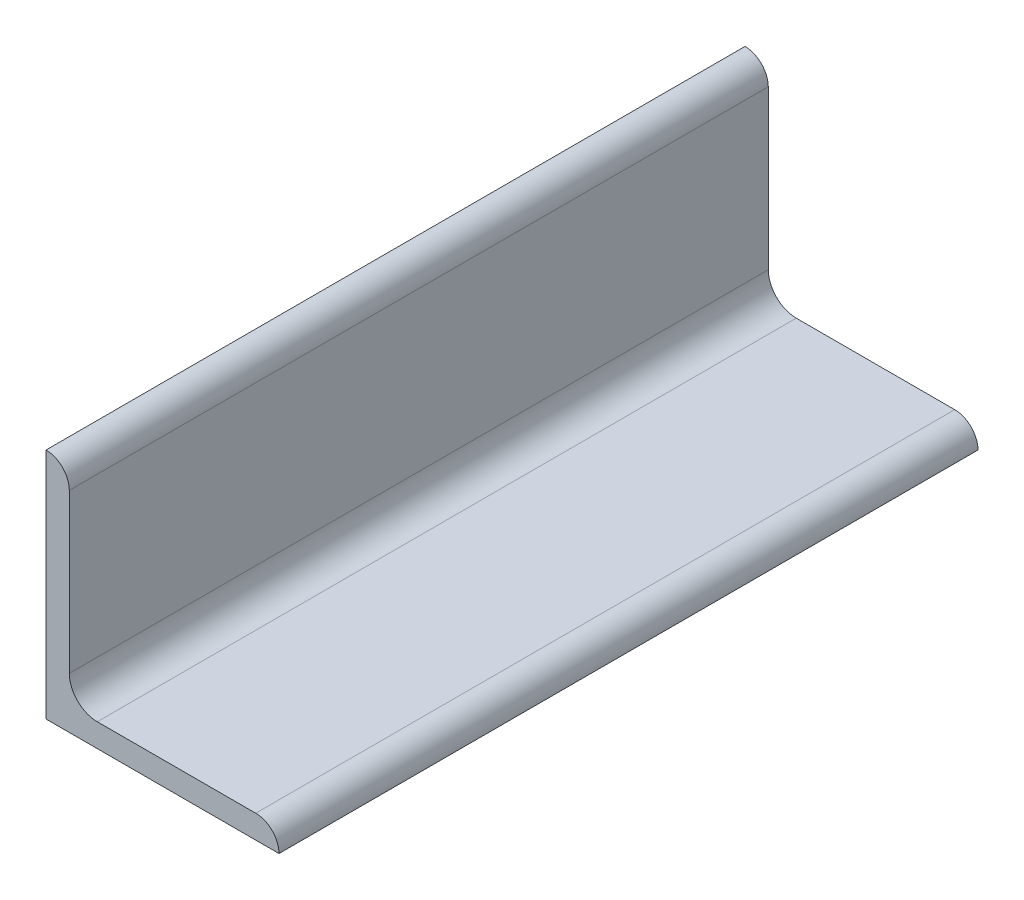
ISO-10303-21;
HEADER;
FILE_DESCRIPTION(('STEP AP214'),'2;1');
FILE_NAME('part.step','',(''),(''),'','','');
FILE_SCHEMA(('AUTOMOTIVE_DESIGN { 1 0 10303 214 1 1 1 1 }'));
ENDSEC;
DATA;
#1=APPLICATION_CONTEXT('core data for automotive mechanical design processes');
#2=APPLICATION_PROTOCOL_DEFINITION('international standard','automotive_design',2000,#1);
#3=PRODUCT_CONTEXT('',#1,'mechanical');
#4=PRODUCT('Part','Part','',(#3));
#5=PRODUCT_RELATED_PRODUCT_CATEGORY('part','',(#4));
#6=PRODUCT_DEFINITION_FORMATION('','',#4);
#7=PRODUCT_DEFINITION_CONTEXT('part definition',#1,'design');
#8=PRODUCT_DEFINITION('design','',#6,#7);
#9=PRODUCT_DEFINITION_SHAPE('','',#8);
#10=(LENGTH_UNIT() NAMED_UNIT(*) SI_UNIT(.MILLI.,.METRE.));
#11=(NAMED_UNIT(*) PLANE_ANGLE_UNIT() SI_UNIT($,.RADIAN.));
#12=(NAMED_UNIT(*) SI_UNIT($,.STERADIAN.) SOLID_ANGLE_UNIT());
#13=UNCERTAINTY_MEASURE_WITH_UNIT(LENGTH_MEASURE(1.E-05),#10,'distance_accuracy_value','');
#14=(GEOMETRIC_REPRESENTATION_CONTEXT(3) GLOBAL_UNCERTAINTY_ASSIGNED_CONTEXT((#13)) GLOBAL_UNIT_ASSIGNED_CONTEXT((#10,
#11,#12)) REPRESENTATION_CONTEXT('',''));
#15=CARTESIAN_POINT('',(0.,0.,0.));
#16=DIRECTION('',(0.,0.,1.));
#17=DIRECTION('',(1.,0.,0.));
#18=AXIS2_PLACEMENT_3D('',#15,#16,#17);
#19=CARTESIAN_POINT('',(100.,0.,150.));
#20=DIRECTION('',(0.,1.,0.));
#21=DIRECTION('',(-1.,0.,0.));
#22=AXIS2_PLACEMENT_3D('',#19,#20,#21);
#23=PLANE('',#22);
#24=DIRECTION('',(1.,0.,0.));
#25=VECTOR('',#24,1.);
#26=CARTESIAN_POINT('',(100.,0.,-150.));
#27=LINE('',#26,#25);
#28=CARTESIAN_POINT('',(0.,0.,-150.));
#29=VERTEX_POINT('',#28);
#30=CARTESIAN_POINT('',(100.,0.,-150.));
#31=VERTEX_POINT('',#30);
#32=EDGE_CURVE('E106',#29,#31,#27,.T.);
#33=ORIENTED_EDGE('',*,*,#32,.T.);
#34=DIRECTION('',(0.,0.,-1.));
#35=VECTOR('',#34,1.);
#36=CARTESIAN_POINT('',(100.,0.,150.));
#37=LINE('',#36,#35);
#38=CARTESIAN_POINT('',(100.,0.,150.));
#39=VERTEX_POINT('',#38);
#40=EDGE_CURVE('E104',#39,#31,#37,.T.);
#41=ORIENTED_EDGE('',*,*,#40,.F.);
#42=DIRECTION('',(1.,0.,0.));
#43=VECTOR('',#42,1.);
#44=CARTESIAN_POINT('',(100.,0.,150.));
#45=LINE('',#44,#43);
#46=CARTESIAN_POINT('',(0.,0.,150.));
#47=VERTEX_POINT('',#46);
#48=EDGE_CURVE('E91',#47,#39,#45,.T.);
#49=ORIENTED_EDGE('',*,*,#48,.F.);
#50=DIRECTION('',(0.,0.,-1.));
#51=VECTOR('',#50,1.);
#52=CARTESIAN_POINT('',(0.,0.,150.));
#53=LINE('',#52,#51);
#54=EDGE_CURVE('E126',#47,#29,#53,.T.);
#55=ORIENTED_EDGE('',*,*,#54,.T.);
#56=EDGE_LOOP('',(#33,#41,#49,#55));
#57=FACE_BOUND('',#56,.T.);
#58=ADVANCED_FACE('F32',(#57),#23,.F.);
#59=CARTESIAN_POINT('',(22.,9.99999999999999,150.));
#60=DIRECTION('',(0.,-1.,0.));
#61=DIRECTION('',(0.,0.,-1.));
#62=AXIS2_PLACEMENT_3D('',#59,#60,#61);
#63=PLANE('',#62);
#64=DIRECTION('',(-1.,0.,0.));
#65=VECTOR('',#64,1.);
#66=CARTESIAN_POINT('',(22.,9.99999999999999,150.));
#67=LINE('',#66,#65);
#68=CARTESIAN_POINT('',(90.,9.99999999999999,150.));
#69=VERTEX_POINT('',#68);
#70=CARTESIAN_POINT('',(22.,9.99999999999999,150.));
#71=VERTEX_POINT('',#70);
#72=EDGE_CURVE('E99',#69,#71,#67,.T.);
#73=ORIENTED_EDGE('',*,*,#72,.F.);
#74=DIRECTION('',(0.,0.,-1.));
#75=VECTOR('',#74,1.);
#76=CARTESIAN_POINT('',(90.,9.99999999999999,150.));
#77=LINE('',#76,#75);
#78=CARTESIAN_POINT('',(90.,9.99999999999999,-150.));
#79=VERTEX_POINT('',#78);
#80=EDGE_CURVE('E11',#69,#79,#77,.T.);
#81=ORIENTED_EDGE('',*,*,#80,.T.);
#82=DIRECTION('',(-1.,0.,0.));
#83=VECTOR('',#82,1.);
#84=CARTESIAN_POINT('',(22.,9.99999999999999,-150.));
#85=LINE('',#84,#83);
#86=CARTESIAN_POINT('',(22.,9.99999999999999,-150.));
#87=VERTEX_POINT('',#86);
#88=EDGE_CURVE('E133',#79,#87,#85,.T.);
#89=ORIENTED_EDGE('',*,*,#88,.T.);
#90=DIRECTION('',(0.,0.,-1.));
#91=VECTOR('',#90,1.);
#92=CARTESIAN_POINT('',(22.,9.99999999999999,150.));
#93=LINE('',#92,#91);
#94=EDGE_CURVE('E109',#71,#87,#93,.T.);
#95=ORIENTED_EDGE('',*,*,#94,.F.);
#96=EDGE_LOOP('',(#73,#81,#89,#95));
#97=FACE_BOUND('',#96,.T.);
#98=ADVANCED_FACE('F145',(#97),#63,.F.);
#99=CARTESIAN_POINT('',(22.,22.,150.));
#100=DIRECTION('',(0.,0.,-1.));
#101=DIRECTION('',(-1.,0.,0.));
#102=AXIS2_PLACEMENT_3D('',#99,#100,#101);
#103=CYLINDRICAL_SURFACE('',#102,12.);
#104=CARTESIAN_POINT('',(22.,22.,-150.));
#105=DIRECTION('',(0.,0.,-1.));
#106=DIRECTION('',(-1.,0.,0.));
#107=AXIS2_PLACEMENT_3D('',#104,#105,#106);
#108=CIRCLE('',#107,12.);
#109=CARTESIAN_POINT('',(10.,22.,-150.));
#110=VERTEX_POINT('',#109);
#111=EDGE_CURVE('E131',#87,#110,#108,.T.);
#112=ORIENTED_EDGE('',*,*,#111,.T.);
#113=DIRECTION('',(0.,0.,-1.));
#114=VECTOR('',#113,1.);
#115=CARTESIAN_POINT('',(10.,22.,150.));
#116=LINE('',#115,#114);
#117=CARTESIAN_POINT('',(10.,22.,150.));
#118=VERTEX_POINT('',#117);
#119=EDGE_CURVE('E120',#118,#110,#116,.T.);
#120=ORIENTED_EDGE('',*,*,#119,.F.);
#121=CARTESIAN_POINT('',(22.,22.,150.));
#122=DIRECTION('',(0.,0.,-1.));
#123=DIRECTION('',(-1.,0.,0.));
#124=AXIS2_PLACEMENT_3D('',#121,#122,#123);
#125=CIRCLE('',#124,12.);
#126=EDGE_CURVE('E139',#71,#118,#125,.T.);
#127=ORIENTED_EDGE('',*,*,#126,.F.);
#128=ORIENTED_EDGE('',*,*,#94,.T.);
#129=EDGE_LOOP('',(#112,#120,#127,#128));
#130=FACE_BOUND('',#129,.T.);
#131=ADVANCED_FACE('F149',(#130),#103,.F.);
#132=CARTESIAN_POINT('',(9.99999999999999,100.,150.));
#133=DIRECTION('',(-1.,0.,0.));
#134=DIRECTION('',(0.,-1.,0.));
#135=AXIS2_PLACEMENT_3D('',#132,#133,#134);
#136=PLANE('',#135);
#137=DIRECTION('',(0.,1.,0.));
#138=VECTOR('',#137,1.);
#139=CARTESIAN_POINT('',(9.99999999999999,100.,-150.));
#140=LINE('',#139,#138);
#141=CARTESIAN_POINT('',(10.,90.,-150.));
#142=VERTEX_POINT('',#141);
#143=EDGE_CURVE('E129',#110,#142,#140,.T.);
#144=ORIENTED_EDGE('',*,*,#143,.T.);
#145=DIRECTION('',(0.,0.,-1.));
#146=VECTOR('',#145,1.);
#147=CARTESIAN_POINT('',(10.,90.,150.));
#148=LINE('',#147,#146);
#149=CARTESIAN_POINT('',(10.,90.,150.));
#150=VERTEX_POINT('',#149);
#151=EDGE_CURVE('E55',#142,#150,#148,.F.);
#152=ORIENTED_EDGE('',*,*,#151,.T.);
#153=DIRECTION('',(0.,1.,0.));
#154=VECTOR('',#153,1.);
#155=CARTESIAN_POINT('',(9.99999999999999,100.,150.));
#156=LINE('',#155,#154);
#157=EDGE_CURVE('E137',#118,#150,#156,.T.);
#158=ORIENTED_EDGE('',*,*,#157,.F.);
#159=ORIENTED_EDGE('',*,*,#119,.T.);
#160=EDGE_LOOP('',(#144,#152,#158,#159));
#161=FACE_BOUND('',#160,.T.);
#162=ADVANCED_FACE('F151',(#161),#136,.F.);
#163=CARTESIAN_POINT('',(0.,100.,150.));
#164=DIRECTION('',(1.,0.,0.));
#165=DIRECTION('',(0.,1.,0.));
#166=AXIS2_PLACEMENT_3D('',#163,#164,#165);
#167=PLANE('',#166);
#168=DIRECTION('',(0.,-1.,0.));
#169=VECTOR('',#168,1.);
#170=CARTESIAN_POINT('',(0.,100.,-150.));
#171=LINE('',#170,#169);
#172=CARTESIAN_POINT('',(0.,100.,-150.));
#173=VERTEX_POINT('',#172);
#174=EDGE_CURVE('E100',#173,#29,#171,.T.);
#175=ORIENTED_EDGE('',*,*,#174,.T.);
#176=ORIENTED_EDGE('',*,*,#54,.F.);
#177=DIRECTION('',(0.,-1.,0.));
#178=VECTOR('',#177,1.);
#179=CARTESIAN_POINT('',(0.,100.,150.));
#180=LINE('',#179,#178);
#181=CARTESIAN_POINT('',(0.,100.,150.));
#182=VERTEX_POINT('',#181);
#183=EDGE_CURVE('E95',#182,#47,#180,.T.);
#184=ORIENTED_EDGE('',*,*,#183,.F.);
#185=DIRECTION('',(0.,0.,-1.));
#186=VECTOR('',#185,1.);
#187=CARTESIAN_POINT('',(0.,100.,150.));
#188=LINE('',#187,#186);
#189=EDGE_CURVE('E123',#182,#173,#188,.T.);
#190=ORIENTED_EDGE('',*,*,#189,.T.);
#191=EDGE_LOOP('',(#175,#176,#184,#190));
#192=FACE_BOUND('',#191,.T.);
#193=ADVANCED_FACE('F158',(#192),#167,.F.);
#194=CARTESIAN_POINT('',(22.,22.,150.));
#195=DIRECTION('',(0.,0.,-1.));
#196=DIRECTION('',(-1.,0.,0.));
#197=AXIS2_PLACEMENT_3D('',#194,#195,#196);
#198=PLANE('',#197);
#199=ORIENTED_EDGE('',*,*,#157,.T.);
#200=CARTESIAN_POINT('',(0.,90.,150.));
#201=DIRECTION('',(0.,0.,-1.));
#202=DIRECTION('',(-1.,0.,0.));
#203=AXIS2_PLACEMENT_3D('',#200,#201,#202);
#204=CIRCLE('',#203,10.);
#205=EDGE_CURVE('E40',#150,#182,#204,.F.);
#206=ORIENTED_EDGE('',*,*,#205,.T.);
#207=ORIENTED_EDGE('',*,*,#183,.T.);
#208=ORIENTED_EDGE('',*,*,#48,.T.);
#209=CARTESIAN_POINT('',(90.,0.,150.));
#210=DIRECTION('',(0.,0.,-1.));
#211=DIRECTION('',(-1.,0.,0.));
#212=AXIS2_PLACEMENT_3D('',#209,#210,#211);
#213=CIRCLE('',#212,10.);
#214=EDGE_CURVE('E47',#39,#69,#213,.F.);
#215=ORIENTED_EDGE('',*,*,#214,.T.);
#216=ORIENTED_EDGE('',*,*,#72,.T.);
#217=ORIENTED_EDGE('',*,*,#126,.T.);
#218=EDGE_LOOP('',(#199,#206,#207,#208,#215,#216,#217));
#219=FACE_BOUND('',#218,.T.);
#220=ADVANCED_FACE('F93',(#219),#198,.F.);
#221=CARTESIAN_POINT('',(22.,22.,-150.));
#222=DIRECTION('',(0.,0.,-1.));
#223=DIRECTION('',(-1.,0.,0.));
#224=AXIS2_PLACEMENT_3D('',#221,#222,#223);
#225=PLANE('',#224);
#226=ORIENTED_EDGE('',*,*,#174,.F.);
#227=CARTESIAN_POINT('',(0.,90.,-150.));
#228=DIRECTION('',(0.,0.,-1.));
#229=DIRECTION('',(-1.,0.,0.));
#230=AXIS2_PLACEMENT_3D('',#227,#228,#229);
#231=CIRCLE('',#230,10.);
#232=EDGE_CURVE('E113',#173,#142,#231,.T.);
#233=ORIENTED_EDGE('',*,*,#232,.T.);
#234=ORIENTED_EDGE('',*,*,#143,.F.);
#235=ORIENTED_EDGE('',*,*,#111,.F.);
#236=ORIENTED_EDGE('',*,*,#88,.F.);
#237=CARTESIAN_POINT('',(90.,0.,-150.));
#238=DIRECTION('',(0.,0.,-1.));
#239=DIRECTION('',(-1.,0.,0.));
#240=AXIS2_PLACEMENT_3D('',#237,#238,#239);
#241=CIRCLE('',#240,10.);
#242=EDGE_CURVE('E108',#79,#31,#241,.T.);
#243=ORIENTED_EDGE('',*,*,#242,.T.);
#244=ORIENTED_EDGE('',*,*,#32,.F.);
#245=EDGE_LOOP('',(#226,#233,#234,#235,#236,#243,#244));
#246=FACE_BOUND('',#245,.T.);
#247=ADVANCED_FACE('F160',(#246),#225,.T.);
#248=CARTESIAN_POINT('',(0.,90.,150.));
#249=DIRECTION('',(0.,0.,-1.));
#250=DIRECTION('',(-1.,0.,0.));
#251=AXIS2_PLACEMENT_3D('',#248,#249,#250);
#252=CYLINDRICAL_SURFACE('',#251,10.);
#253=ORIENTED_EDGE('',*,*,#205,.F.);
#254=ORIENTED_EDGE('',*,*,#151,.F.);
#255=ORIENTED_EDGE('',*,*,#232,.F.);
#256=ORIENTED_EDGE('',*,*,#189,.F.);
#257=EDGE_LOOP('',(#253,#254,#255,#256));
#258=FACE_BOUND('',#257,.T.);
#259=ADVANCED_FACE('F155',(#258),#252,.T.);
#260=CARTESIAN_POINT('',(90.,0.,150.));
#261=DIRECTION('',(0.,0.,-1.));
#262=DIRECTION('',(-1.,0.,0.));
#263=AXIS2_PLACEMENT_3D('',#260,#261,#262);
#264=CYLINDRICAL_SURFACE('',#263,10.);
#265=ORIENTED_EDGE('',*,*,#214,.F.);
#266=ORIENTED_EDGE('',*,*,#40,.T.);
#267=ORIENTED_EDGE('',*,*,#242,.F.);
#268=ORIENTED_EDGE('',*,*,#80,.F.);
#269=EDGE_LOOP('',(#265,#266,#267,#268));
#270=FACE_BOUND('',#269,.T.);
#271=ADVANCED_FACE('F34',(#270),#264,.T.);
#272=CLOSED_SHELL('',(#58,#98,#131,#162,#193,#220,#247,#259,#271));
#273=MANIFOLD_SOLID_BREP('B2',#272);
#274=ADVANCED_BREP_SHAPE_REPRESENTATION('',(#18,#273),#14);
#275=SHAPE_DEFINITION_REPRESENTATION(#9,#274);
ENDSEC;
END-ISO-10303-21;
